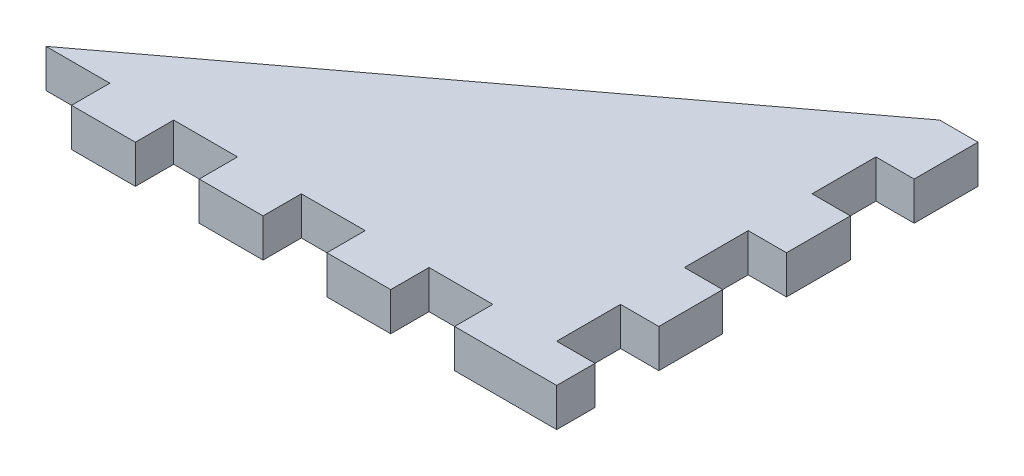
ISO-10303-21;
HEADER;
FILE_DESCRIPTION(('STEP AP214'),'2;1');
FILE_NAME('part.step','',(''),(''),'','','');
FILE_SCHEMA(('AUTOMOTIVE_DESIGN { 1 0 10303 214 1 1 1 1 }'));
ENDSEC;
DATA;
#1=APPLICATION_CONTEXT('core data for automotive mechanical design processes');
#2=APPLICATION_PROTOCOL_DEFINITION('international standard','automotive_design',2000,#1);
#3=PRODUCT_CONTEXT('',#1,'mechanical');
#4=PRODUCT('Part','Part','',(#3));
#5=PRODUCT_RELATED_PRODUCT_CATEGORY('part','',(#4));
#6=PRODUCT_DEFINITION_FORMATION('','',#4);
#7=PRODUCT_DEFINITION_CONTEXT('part definition',#1,'design');
#8=PRODUCT_DEFINITION('design','',#6,#7);
#9=PRODUCT_DEFINITION_SHAPE('','',#8);
#10=(LENGTH_UNIT() NAMED_UNIT(*) SI_UNIT(.MILLI.,.METRE.));
#11=(NAMED_UNIT(*) PLANE_ANGLE_UNIT() SI_UNIT($,.RADIAN.));
#12=(NAMED_UNIT(*) SI_UNIT($,.STERADIAN.) SOLID_ANGLE_UNIT());
#13=UNCERTAINTY_MEASURE_WITH_UNIT(LENGTH_MEASURE(1.E-05),#10,'distance_accuracy_value','');
#14=(GEOMETRIC_REPRESENTATION_CONTEXT(3) GLOBAL_UNCERTAINTY_ASSIGNED_CONTEXT((#13)) GLOBAL_UNIT_ASSIGNED_CONTEXT((#10,
#11,#12)) REPRESENTATION_CONTEXT('',''));
#15=CARTESIAN_POINT('',(0.,0.,0.));
#16=DIRECTION('',(0.,0.,1.));
#17=DIRECTION('',(1.,0.,0.));
#18=AXIS2_PLACEMENT_3D('',#15,#16,#17);
#19=CARTESIAN_POINT('',(20.,1.5,0.));
#20=DIRECTION('',(1.,0.,0.));
#21=DIRECTION('',(0.,0.,-1.));
#22=AXIS2_PLACEMENT_3D('',#19,#20,#21);
#23=PLANE('',#22);
#24=DIRECTION('',(0.,0.,1.));
#25=VECTOR('',#24,1.);
#26=CARTESIAN_POINT('',(20.,1.5,0.));
#27=LINE('',#26,#25);
#28=CARTESIAN_POINT('',(20.,1.5,9.99999999999999));
#29=VERTEX_POINT('',#28);
#30=CARTESIAN_POINT('',(20.,1.5,15.));
#31=VERTEX_POINT('',#30);
#32=EDGE_CURVE('E517',#29,#31,#27,.T.);
#33=ORIENTED_EDGE('',*,*,#32,.T.);
#34=DIRECTION('',(0.,1.,0.));
#35=VECTOR('',#34,1.);
#36=CARTESIAN_POINT('',(20.,-1.5,15.));
#37=LINE('',#36,#35);
#38=CARTESIAN_POINT('',(20.,-1.5,15.));
#39=VERTEX_POINT('',#38);
#40=EDGE_CURVE('E269',#39,#31,#37,.T.);
#41=ORIENTED_EDGE('',*,*,#40,.F.);
#42=DIRECTION('',(0.,0.,1.));
#43=VECTOR('',#42,1.);
#44=CARTESIAN_POINT('',(20.,-1.5,0.));
#45=LINE('',#44,#43);
#46=CARTESIAN_POINT('',(20.,-1.5,9.99999999999999));
#47=VERTEX_POINT('',#46);
#48=EDGE_CURVE('E510',#47,#39,#45,.T.);
#49=ORIENTED_EDGE('',*,*,#48,.F.);
#50=DIRECTION('',(0.,-1.,0.));
#51=VECTOR('',#50,1.);
#52=CARTESIAN_POINT('',(20.,0.,9.99999999999999));
#53=LINE('',#52,#51);
#54=EDGE_CURVE('E409',#29,#47,#53,.T.);
#55=ORIENTED_EDGE('',*,*,#54,.F.);
#56=EDGE_LOOP('',(#33,#41,#49,#55));
#57=FACE_BOUND('',#56,.T.);
#58=ADVANCED_FACE('F41',(#57),#23,.T.);
#59=CARTESIAN_POINT('',(0.,1.5,15.));
#60=DIRECTION('',(0.,0.,-1.));
#61=DIRECTION('',(-1.,0.,0.));
#62=AXIS2_PLACEMENT_3D('',#59,#60,#61);
#63=PLANE('',#62);
#64=DIRECTION('',(0.,-1.,0.));
#65=VECTOR('',#64,1.);
#66=CARTESIAN_POINT('',(-15.,0.,15.));
#67=LINE('',#66,#65);
#68=CARTESIAN_POINT('',(-15.,1.5,15.));
#69=VERTEX_POINT('',#68);
#70=CARTESIAN_POINT('',(-15.,-1.5,15.));
#71=VERTEX_POINT('',#70);
#72=EDGE_CURVE('E65',#69,#71,#67,.T.);
#73=ORIENTED_EDGE('',*,*,#72,.F.);
#74=DIRECTION('',(1.,0.,0.));
#75=VECTOR('',#74,1.);
#76=CARTESIAN_POINT('',(0.,1.5,15.));
#77=LINE('',#76,#75);
#78=CARTESIAN_POINT('',(-20.,1.5,15.));
#79=VERTEX_POINT('',#78);
#80=EDGE_CURVE('E521',#79,#69,#77,.T.);
#81=ORIENTED_EDGE('',*,*,#80,.F.);
#82=DIRECTION('',(0.,-1.,0.));
#83=VECTOR('',#82,1.);
#84=CARTESIAN_POINT('',(-20.,1.5,15.));
#85=LINE('',#84,#83);
#86=CARTESIAN_POINT('',(-20.,-1.5,15.));
#87=VERTEX_POINT('',#86);
#88=EDGE_CURVE('E50',#79,#87,#85,.T.);
#89=ORIENTED_EDGE('',*,*,#88,.T.);
#90=DIRECTION('',(1.,0.,0.));
#91=VECTOR('',#90,1.);
#92=CARTESIAN_POINT('',(0.,-1.5,15.));
#93=LINE('',#92,#91);
#94=EDGE_CURVE('E533',#87,#71,#93,.T.);
#95=ORIENTED_EDGE('',*,*,#94,.T.);
#96=EDGE_LOOP('',(#73,#81,#89,#95));
#97=FACE_BOUND('',#96,.T.);
#98=ADVANCED_FACE('F540',(#97),#63,.F.);
#99=CARTESIAN_POINT('',(-10.,1.5,15.));
#100=VERTEX_POINT('',#99);
#101=CARTESIAN_POINT('',(-5.,1.5,15.));
#102=VERTEX_POINT('',#101);
#103=EDGE_CURVE('E57',#100,#102,#77,.T.);
#104=ORIENTED_EDGE('',*,*,#103,.F.);
#105=DIRECTION('',(0.,-1.,0.));
#106=VECTOR('',#105,1.);
#107=CARTESIAN_POINT('',(-10.,0.,15.));
#108=LINE('',#107,#106);
#109=CARTESIAN_POINT('',(-10.,-1.5,15.));
#110=VERTEX_POINT('',#109);
#111=EDGE_CURVE('E289',#100,#110,#108,.T.);
#112=ORIENTED_EDGE('',*,*,#111,.T.);
#113=CARTESIAN_POINT('',(-5.,-1.5,15.));
#114=VERTEX_POINT('',#113);
#115=EDGE_CURVE('E535',#110,#114,#93,.T.);
#116=ORIENTED_EDGE('',*,*,#115,.T.);
#117=DIRECTION('',(0.,-1.,0.));
#118=VECTOR('',#117,1.);
#119=CARTESIAN_POINT('',(-5.,0.,15.));
#120=LINE('',#119,#118);
#121=EDGE_CURVE('E318',#102,#114,#120,.T.);
#122=ORIENTED_EDGE('',*,*,#121,.F.);
#123=EDGE_LOOP('',(#104,#112,#116,#122));
#124=FACE_BOUND('',#123,.T.);
#125=ADVANCED_FACE('F630',(#124),#63,.F.);
#126=CARTESIAN_POINT('',(0.,1.5,15.));
#127=VERTEX_POINT('',#126);
#128=CARTESIAN_POINT('',(5.,1.5,15.));
#129=VERTEX_POINT('',#128);
#130=EDGE_CURVE('E626',#127,#129,#77,.T.);
#131=ORIENTED_EDGE('',*,*,#130,.F.);
#132=DIRECTION('',(0.,-1.,0.));
#133=VECTOR('',#132,1.);
#134=CARTESIAN_POINT('',(0.,0.,15.));
#135=LINE('',#134,#133);
#136=CARTESIAN_POINT('',(0.,-1.5,15.));
#137=VERTEX_POINT('',#136);
#138=EDGE_CURVE('E324',#127,#137,#135,.T.);
#139=ORIENTED_EDGE('',*,*,#138,.T.);
#140=CARTESIAN_POINT('',(5.,-1.5,15.));
#141=VERTEX_POINT('',#140);
#142=EDGE_CURVE('E609',#137,#141,#93,.T.);
#143=ORIENTED_EDGE('',*,*,#142,.T.);
#144=DIRECTION('',(0.,-1.,0.));
#145=VECTOR('',#144,1.);
#146=CARTESIAN_POINT('',(5.,0.,15.));
#147=LINE('',#146,#145);
#148=EDGE_CURVE('E356',#129,#141,#147,.T.);
#149=ORIENTED_EDGE('',*,*,#148,.F.);
#150=EDGE_LOOP('',(#131,#139,#143,#149));
#151=FACE_BOUND('',#150,.T.);
#152=ADVANCED_FACE('F625',(#151),#63,.F.);
#153=DIRECTION('',(0.,-1.,0.));
#154=VECTOR('',#153,1.);
#155=CARTESIAN_POINT('',(20.,0.,4.99999999999999));
#156=LINE('',#155,#154);
#157=CARTESIAN_POINT('',(20.,1.5,4.99999999999999));
#158=VERTEX_POINT('',#157);
#159=CARTESIAN_POINT('',(20.,-1.5,4.99999999999999));
#160=VERTEX_POINT('',#159);
#161=EDGE_CURVE('E415',#158,#160,#156,.T.);
#162=ORIENTED_EDGE('',*,*,#161,.T.);
#163=CARTESIAN_POINT('',(20.,-1.5,0.));
#164=VERTEX_POINT('',#163);
#165=EDGE_CURVE('E529',#164,#160,#45,.T.);
#166=ORIENTED_EDGE('',*,*,#165,.F.);
#167=DIRECTION('',(0.,-1.,0.));
#168=VECTOR('',#167,1.);
#169=CARTESIAN_POINT('',(20.,0.,0.));
#170=LINE('',#169,#168);
#171=CARTESIAN_POINT('',(20.,1.5,0.));
#172=VERTEX_POINT('',#171);
#173=EDGE_CURVE('E443',#172,#164,#170,.T.);
#174=ORIENTED_EDGE('',*,*,#173,.F.);
#175=EDGE_CURVE('E516',#172,#158,#27,.T.);
#176=ORIENTED_EDGE('',*,*,#175,.T.);
#177=EDGE_LOOP('',(#162,#166,#174,#176));
#178=FACE_BOUND('',#177,.T.);
#179=ADVANCED_FACE('F648',(#178),#23,.T.);
#180=DIRECTION('',(0.,-1.,0.));
#181=VECTOR('',#180,1.);
#182=CARTESIAN_POINT('',(20.,0.,-5.00000000000001));
#183=LINE('',#182,#181);
#184=CARTESIAN_POINT('',(20.,1.5,-5.00000000000001));
#185=VERTEX_POINT('',#184);
#186=CARTESIAN_POINT('',(20.,-1.5,-5.00000000000001));
#187=VERTEX_POINT('',#186);
#188=EDGE_CURVE('E449',#185,#187,#183,.T.);
#189=ORIENTED_EDGE('',*,*,#188,.T.);
#190=CARTESIAN_POINT('',(20.,-1.5,-10.));
#191=VERTEX_POINT('',#190);
#192=EDGE_CURVE('E524',#191,#187,#45,.T.);
#193=ORIENTED_EDGE('',*,*,#192,.F.);
#194=DIRECTION('',(0.,-1.,0.));
#195=VECTOR('',#194,1.);
#196=CARTESIAN_POINT('',(20.,0.,-10.));
#197=LINE('',#196,#195);
#198=CARTESIAN_POINT('',(20.,1.5,-10.));
#199=VERTEX_POINT('',#198);
#200=EDGE_CURVE('E477',#199,#191,#197,.T.);
#201=ORIENTED_EDGE('',*,*,#200,.F.);
#202=EDGE_CURVE('E511',#199,#185,#27,.T.);
#203=ORIENTED_EDGE('',*,*,#202,.T.);
#204=EDGE_LOOP('',(#189,#193,#201,#203));
#205=FACE_BOUND('',#204,.T.);
#206=ADVANCED_FACE('F43',(#205),#23,.T.);
#207=CARTESIAN_POINT('',(0.,1.5,0.));
#208=DIRECTION('',(0.6,0.,0.8));
#209=DIRECTION('',(0.8,0.,-0.6));
#210=AXIS2_PLACEMENT_3D('',#207,#208,#209);
#211=PLANE('',#210);
#212=DIRECTION('',(-0.8,0.,0.6));
#213=VECTOR('',#212,1.);
#214=CARTESIAN_POINT('',(0.,-1.5,0.));
#215=LINE('',#214,#213);
#216=CARTESIAN_POINT('',(20.,-1.5,-15.));
#217=VERTEX_POINT('',#216);
#218=EDGE_CURVE('E528',#217,#87,#215,.T.);
#219=ORIENTED_EDGE('',*,*,#218,.T.);
#220=ORIENTED_EDGE('',*,*,#88,.F.);
#221=DIRECTION('',(-0.8,0.,0.6));
#222=VECTOR('',#221,1.);
#223=CARTESIAN_POINT('',(0.,1.5,0.));
#224=LINE('',#223,#222);
#225=CARTESIAN_POINT('',(20.,1.5,-15.));
#226=VERTEX_POINT('',#225);
#227=EDGE_CURVE('E515',#226,#79,#224,.T.);
#228=ORIENTED_EDGE('',*,*,#227,.F.);
#229=DIRECTION('',(0.,-1.,0.));
#230=VECTOR('',#229,1.);
#231=CARTESIAN_POINT('',(20.,1.5,-15.));
#232=LINE('',#231,#230);
#233=EDGE_CURVE('E11',#226,#217,#232,.T.);
#234=ORIENTED_EDGE('',*,*,#233,.T.);
#235=EDGE_LOOP('',(#219,#220,#228,#234));
#236=FACE_BOUND('',#235,.T.);
#237=ADVANCED_FACE('F557',(#236),#211,.F.);
#238=CARTESIAN_POINT('',(10.,1.5,15.));
#239=VERTEX_POINT('',#238);
#240=CARTESIAN_POINT('',(15.,1.5,15.));
#241=VERTEX_POINT('',#240);
#242=EDGE_CURVE('E520',#239,#241,#77,.T.);
#243=ORIENTED_EDGE('',*,*,#242,.F.);
#244=DIRECTION('',(0.,-1.,0.));
#245=VECTOR('',#244,1.);
#246=CARTESIAN_POINT('',(10.,0.,15.));
#247=LINE('',#246,#245);
#248=CARTESIAN_POINT('',(10.,-1.5,15.));
#249=VERTEX_POINT('',#248);
#250=EDGE_CURVE('E362',#239,#249,#247,.T.);
#251=ORIENTED_EDGE('',*,*,#250,.T.);
#252=CARTESIAN_POINT('',(15.,-1.5,15.));
#253=VERTEX_POINT('',#252);
#254=EDGE_CURVE('E532',#249,#253,#93,.T.);
#255=ORIENTED_EDGE('',*,*,#254,.T.);
#256=DIRECTION('',(0.,1.,0.));
#257=VECTOR('',#256,1.);
#258=CARTESIAN_POINT('',(15.,0.,15.));
#259=LINE('',#258,#257);
#260=EDGE_CURVE('E394',#253,#241,#259,.T.);
#261=ORIENTED_EDGE('',*,*,#260,.T.);
#262=EDGE_LOOP('',(#243,#251,#255,#261));
#263=FACE_BOUND('',#262,.T.);
#264=ADVANCED_FACE('F611',(#263),#63,.F.);
#265=CARTESIAN_POINT('',(0.,1.5,0.));
#266=DIRECTION('',(0.,1.,0.));
#267=DIRECTION('',(0.,0.,1.));
#268=AXIS2_PLACEMENT_3D('',#265,#266,#267);
#269=PLANE('',#268);
#270=ORIENTED_EDGE('',*,*,#202,.F.);
#271=DIRECTION('',(-1.,0.,0.));
#272=VECTOR('',#271,1.);
#273=CARTESIAN_POINT('',(23.,1.5,-10.));
#274=LINE('',#273,#272);
#275=CARTESIAN_POINT('',(23.,1.5,-10.));
#276=VERTEX_POINT('',#275);
#277=EDGE_CURVE('E506',#276,#199,#274,.T.);
#278=ORIENTED_EDGE('',*,*,#277,.F.);
#279=DIRECTION('',(0.,0.,1.));
#280=VECTOR('',#279,1.);
#281=CARTESIAN_POINT('',(23.,1.5,0.));
#282=LINE('',#281,#280);
#283=CARTESIAN_POINT('',(23.,1.5,-15.));
#284=VERTEX_POINT('',#283);
#285=EDGE_CURVE('E478',#284,#276,#282,.T.);
#286=ORIENTED_EDGE('',*,*,#285,.F.);
#287=DIRECTION('',(-1.,0.,0.));
#288=VECTOR('',#287,1.);
#289=CARTESIAN_POINT('',(23.,1.5,-15.));
#290=LINE('',#289,#288);
#291=EDGE_CURVE('E491',#284,#226,#290,.T.);
#292=ORIENTED_EDGE('',*,*,#291,.T.);
#293=ORIENTED_EDGE('',*,*,#227,.T.);
#294=ORIENTED_EDGE('',*,*,#80,.T.);
#295=DIRECTION('',(0.,0.,-1.));
#296=VECTOR('',#295,1.);
#297=CARTESIAN_POINT('',(-15.,1.5,18.));
#298=LINE('',#297,#296);
#299=CARTESIAN_POINT('',(-15.,1.5,18.));
#300=VERTEX_POINT('',#299);
#301=EDGE_CURVE('E314',#300,#69,#298,.T.);
#302=ORIENTED_EDGE('',*,*,#301,.F.);
#303=DIRECTION('',(-1.,0.,0.));
#304=VECTOR('',#303,1.);
#305=CARTESIAN_POINT('',(0.,1.5,18.));
#306=LINE('',#305,#304);
#307=CARTESIAN_POINT('',(-10.,1.5,18.));
#308=VERTEX_POINT('',#307);
#309=EDGE_CURVE('E284',#308,#300,#306,.T.);
#310=ORIENTED_EDGE('',*,*,#309,.F.);
#311=DIRECTION('',(0.,0.,-1.));
#312=VECTOR('',#311,1.);
#313=CARTESIAN_POINT('',(-10.,1.5,18.));
#314=LINE('',#313,#312);
#315=EDGE_CURVE('E299',#308,#100,#314,.T.);
#316=ORIENTED_EDGE('',*,*,#315,.T.);
#317=ORIENTED_EDGE('',*,*,#103,.T.);
#318=DIRECTION('',(0.,0.,-1.));
#319=VECTOR('',#318,1.);
#320=CARTESIAN_POINT('',(-5.,1.5,18.));
#321=LINE('',#320,#319);
#322=CARTESIAN_POINT('',(-5.,1.5,18.));
#323=VERTEX_POINT('',#322);
#324=EDGE_CURVE('E352',#323,#102,#321,.T.);
#325=ORIENTED_EDGE('',*,*,#324,.F.);
#326=DIRECTION('',(-1.,0.,0.));
#327=VECTOR('',#326,1.);
#328=CARTESIAN_POINT('',(0.,1.5,18.));
#329=LINE('',#328,#327);
#330=CARTESIAN_POINT('',(0.,1.5,18.));
#331=VERTEX_POINT('',#330);
#332=EDGE_CURVE('E319',#331,#323,#329,.T.);
#333=ORIENTED_EDGE('',*,*,#332,.F.);
#334=DIRECTION('',(0.,0.,-1.));
#335=VECTOR('',#334,1.);
#336=CARTESIAN_POINT('',(0.,1.5,18.));
#337=LINE('',#336,#335);
#338=EDGE_CURVE('E334',#331,#127,#337,.T.);
#339=ORIENTED_EDGE('',*,*,#338,.T.);
#340=ORIENTED_EDGE('',*,*,#130,.T.);
#341=DIRECTION('',(0.,0.,-1.));
#342=VECTOR('',#341,1.);
#343=CARTESIAN_POINT('',(5.,1.5,18.));
#344=LINE('',#343,#342);
#345=CARTESIAN_POINT('',(5.,1.5,18.));
#346=VERTEX_POINT('',#345);
#347=EDGE_CURVE('E390',#346,#129,#344,.T.);
#348=ORIENTED_EDGE('',*,*,#347,.F.);
#349=DIRECTION('',(-1.,0.,0.));
#350=VECTOR('',#349,1.);
#351=CARTESIAN_POINT('',(0.,1.5,18.));
#352=LINE('',#351,#350);
#353=CARTESIAN_POINT('',(10.,1.5,18.));
#354=VERTEX_POINT('',#353);
#355=EDGE_CURVE('E357',#354,#346,#352,.T.);
#356=ORIENTED_EDGE('',*,*,#355,.F.);
#357=DIRECTION('',(0.,0.,-1.));
#358=VECTOR('',#357,1.);
#359=CARTESIAN_POINT('',(10.,1.5,18.));
#360=LINE('',#359,#358);
#361=EDGE_CURVE('E372',#354,#239,#360,.T.);
#362=ORIENTED_EDGE('',*,*,#361,.T.);
#363=ORIENTED_EDGE('',*,*,#242,.T.);
#364=DIRECTION('',(0.,0.,-1.));
#365=VECTOR('',#364,1.);
#366=CARTESIAN_POINT('',(15.,1.5,18.));
#367=LINE('',#366,#365);
#368=CARTESIAN_POINT('',(15.,1.5,18.));
#369=VERTEX_POINT('',#368);
#370=EDGE_CURVE('E399',#369,#241,#367,.T.);
#371=ORIENTED_EDGE('',*,*,#370,.F.);
#372=DIRECTION('',(-1.,0.,0.));
#373=VECTOR('',#372,1.);
#374=CARTESIAN_POINT('',(0.,1.5,18.));
#375=LINE('',#374,#373);
#376=CARTESIAN_POINT('',(23.,1.5,18.));
#377=VERTEX_POINT('',#376);
#378=EDGE_CURVE('E251',#377,#369,#375,.T.);
#379=ORIENTED_EDGE('',*,*,#378,.F.);
#380=DIRECTION('',(0.,0.,1.));
#381=VECTOR('',#380,1.);
#382=CARTESIAN_POINT('',(23.,1.5,18.));
#383=LINE('',#382,#381);
#384=CARTESIAN_POINT('',(23.,1.5,15.));
#385=VERTEX_POINT('',#384);
#386=EDGE_CURVE('E267',#385,#377,#383,.T.);
#387=ORIENTED_EDGE('',*,*,#386,.F.);
#388=DIRECTION('',(-1.,0.,0.));
#389=VECTOR('',#388,1.);
#390=CARTESIAN_POINT('',(23.,1.5,15.));
#391=LINE('',#390,#389);
#392=EDGE_CURVE('E277',#385,#31,#391,.T.);
#393=ORIENTED_EDGE('',*,*,#392,.T.);
#394=ORIENTED_EDGE('',*,*,#32,.F.);
#395=DIRECTION('',(-1.,0.,0.));
#396=VECTOR('',#395,1.);
#397=CARTESIAN_POINT('',(23.,1.5,9.99999999999999));
#398=LINE('',#397,#396);
#399=CARTESIAN_POINT('',(23.,1.5,9.99999999999999));
#400=VERTEX_POINT('',#399);
#401=EDGE_CURVE('E440',#400,#29,#398,.T.);
#402=ORIENTED_EDGE('',*,*,#401,.F.);
#403=DIRECTION('',(0.,0.,1.));
#404=VECTOR('',#403,1.);
#405=CARTESIAN_POINT('',(23.,1.5,0.));
#406=LINE('',#405,#404);
#407=CARTESIAN_POINT('',(23.,1.5,4.99999999999999));
#408=VERTEX_POINT('',#407);
#409=EDGE_CURVE('E410',#408,#400,#406,.T.);
#410=ORIENTED_EDGE('',*,*,#409,.F.);
#411=DIRECTION('',(-1.,0.,0.));
#412=VECTOR('',#411,1.);
#413=CARTESIAN_POINT('',(23.,1.5,4.99999999999999));
#414=LINE('',#413,#412);
#415=EDGE_CURVE('E425',#408,#158,#414,.T.);
#416=ORIENTED_EDGE('',*,*,#415,.T.);
#417=ORIENTED_EDGE('',*,*,#175,.F.);
#418=DIRECTION('',(-1.,0.,0.));
#419=VECTOR('',#418,1.);
#420=CARTESIAN_POINT('',(23.,1.5,0.));
#421=LINE('',#420,#419);
#422=CARTESIAN_POINT('',(23.,1.5,0.));
#423=VERTEX_POINT('',#422);
#424=EDGE_CURVE('E474',#423,#172,#421,.T.);
#425=ORIENTED_EDGE('',*,*,#424,.F.);
#426=DIRECTION('',(0.,0.,1.));
#427=VECTOR('',#426,1.);
#428=CARTESIAN_POINT('',(23.,1.5,0.));
#429=LINE('',#428,#427);
#430=CARTESIAN_POINT('',(23.,1.5,-5.00000000000001));
#431=VERTEX_POINT('',#430);
#432=EDGE_CURVE('E444',#431,#423,#429,.T.);
#433=ORIENTED_EDGE('',*,*,#432,.F.);
#434=DIRECTION('',(-1.,0.,0.));
#435=VECTOR('',#434,1.);
#436=CARTESIAN_POINT('',(23.,1.5,-5.00000000000001));
#437=LINE('',#436,#435);
#438=EDGE_CURVE('E459',#431,#185,#437,.T.);
#439=ORIENTED_EDGE('',*,*,#438,.T.);
#440=EDGE_LOOP('',(#270,#278,#286,#292,#293,#294,#302,#310,#316,#317,#325,#333,#339,#340,#348,
#356,#362,#363,#371,#379,#387,#393,#394,#402,#410,#416,#417,#425,#433,#439));
#441=FACE_BOUND('',#440,.T.);
#442=ADVANCED_FACE('F552',(#441),#269,.T.);
#443=CARTESIAN_POINT('',(0.,-1.5,0.));
#444=DIRECTION('',(0.,1.,0.));
#445=DIRECTION('',(0.,0.,1.));
#446=AXIS2_PLACEMENT_3D('',#443,#444,#445);
#447=PLANE('',#446);
#448=ORIENTED_EDGE('',*,*,#218,.F.);
#449=DIRECTION('',(-1.,0.,0.));
#450=VECTOR('',#449,1.);
#451=CARTESIAN_POINT('',(23.,-1.5,-15.));
#452=LINE('',#451,#450);
#453=CARTESIAN_POINT('',(23.,-1.5,-15.));
#454=VERTEX_POINT('',#453);
#455=EDGE_CURVE('E498',#454,#217,#452,.T.);
#456=ORIENTED_EDGE('',*,*,#455,.F.);
#457=DIRECTION('',(0.,0.,-1.));
#458=VECTOR('',#457,1.);
#459=CARTESIAN_POINT('',(23.,-1.5,0.));
#460=LINE('',#459,#458);
#461=CARTESIAN_POINT('',(23.,-1.5,-10.));
#462=VERTEX_POINT('',#461);
#463=EDGE_CURVE('E485',#462,#454,#460,.T.);
#464=ORIENTED_EDGE('',*,*,#463,.F.);
#465=DIRECTION('',(-1.,0.,0.));
#466=VECTOR('',#465,1.);
#467=CARTESIAN_POINT('',(23.,-1.5,-10.));
#468=LINE('',#467,#466);
#469=EDGE_CURVE('E502',#462,#191,#468,.T.);
#470=ORIENTED_EDGE('',*,*,#469,.T.);
#471=ORIENTED_EDGE('',*,*,#192,.T.);
#472=DIRECTION('',(-1.,0.,0.));
#473=VECTOR('',#472,1.);
#474=CARTESIAN_POINT('',(23.,-1.5,-5.00000000000001));
#475=LINE('',#474,#473);
#476=CARTESIAN_POINT('',(23.,-1.5,-5.00000000000001));
#477=VERTEX_POINT('',#476);
#478=EDGE_CURVE('E468',#477,#187,#475,.T.);
#479=ORIENTED_EDGE('',*,*,#478,.F.);
#480=DIRECTION('',(0.,0.,-1.));
#481=VECTOR('',#480,1.);
#482=CARTESIAN_POINT('',(23.,-1.5,0.));
#483=LINE('',#482,#481);
#484=CARTESIAN_POINT('',(23.,-1.5,0.));
#485=VERTEX_POINT('',#484);
#486=EDGE_CURVE('E452',#485,#477,#483,.T.);
#487=ORIENTED_EDGE('',*,*,#486,.F.);
#488=DIRECTION('',(-1.,0.,0.));
#489=VECTOR('',#488,1.);
#490=CARTESIAN_POINT('',(23.,-1.5,0.));
#491=LINE('',#490,#489);
#492=EDGE_CURVE('E471',#485,#164,#491,.T.);
#493=ORIENTED_EDGE('',*,*,#492,.T.);
#494=ORIENTED_EDGE('',*,*,#165,.T.);
#495=DIRECTION('',(-1.,0.,0.));
#496=VECTOR('',#495,1.);
#497=CARTESIAN_POINT('',(23.,-1.5,4.99999999999999));
#498=LINE('',#497,#496);
#499=CARTESIAN_POINT('',(23.,-1.5,4.99999999999999));
#500=VERTEX_POINT('',#499);
#501=EDGE_CURVE('E434',#500,#160,#498,.T.);
#502=ORIENTED_EDGE('',*,*,#501,.F.);
#503=DIRECTION('',(0.,0.,-1.));
#504=VECTOR('',#503,1.);
#505=CARTESIAN_POINT('',(23.,-1.5,0.));
#506=LINE('',#505,#504);
#507=CARTESIAN_POINT('',(23.,-1.5,9.99999999999999));
#508=VERTEX_POINT('',#507);
#509=EDGE_CURVE('E418',#508,#500,#506,.T.);
#510=ORIENTED_EDGE('',*,*,#509,.F.);
#511=DIRECTION('',(-1.,0.,0.));
#512=VECTOR('',#511,1.);
#513=CARTESIAN_POINT('',(23.,-1.5,9.99999999999999));
#514=LINE('',#513,#512);
#515=EDGE_CURVE('E437',#508,#47,#514,.T.);
#516=ORIENTED_EDGE('',*,*,#515,.T.);
#517=ORIENTED_EDGE('',*,*,#48,.T.);
#518=DIRECTION('',(-1.,0.,0.));
#519=VECTOR('',#518,1.);
#520=CARTESIAN_POINT('',(23.,-1.5,15.));
#521=LINE('',#520,#519);
#522=CARTESIAN_POINT('',(23.,-1.5,15.));
#523=VERTEX_POINT('',#522);
#524=EDGE_CURVE('E258',#523,#39,#521,.T.);
#525=ORIENTED_EDGE('',*,*,#524,.F.);
#526=DIRECTION('',(0.,0.,-1.));
#527=VECTOR('',#526,1.);
#528=CARTESIAN_POINT('',(23.,-1.5,18.));
#529=LINE('',#528,#527);
#530=CARTESIAN_POINT('',(23.,-1.5,18.));
#531=VERTEX_POINT('',#530);
#532=EDGE_CURVE('E254',#531,#523,#529,.T.);
#533=ORIENTED_EDGE('',*,*,#532,.F.);
#534=DIRECTION('',(1.,0.,0.));
#535=VECTOR('',#534,1.);
#536=CARTESIAN_POINT('',(0.,-1.5,18.));
#537=LINE('',#536,#535);
#538=CARTESIAN_POINT('',(15.,-1.5,18.));
#539=VERTEX_POINT('',#538);
#540=EDGE_CURVE('E241',#539,#531,#537,.T.);
#541=ORIENTED_EDGE('',*,*,#540,.F.);
#542=DIRECTION('',(0.,0.,-1.));
#543=VECTOR('',#542,1.);
#544=CARTESIAN_POINT('',(15.,-1.5,18.));
#545=LINE('',#544,#543);
#546=EDGE_CURVE('E406',#539,#253,#545,.T.);
#547=ORIENTED_EDGE('',*,*,#546,.T.);
#548=ORIENTED_EDGE('',*,*,#254,.F.);
#549=DIRECTION('',(0.,0.,-1.));
#550=VECTOR('',#549,1.);
#551=CARTESIAN_POINT('',(10.,-1.5,18.));
#552=LINE('',#551,#550);
#553=CARTESIAN_POINT('',(10.,-1.5,18.));
#554=VERTEX_POINT('',#553);
#555=EDGE_CURVE('E382',#554,#249,#552,.T.);
#556=ORIENTED_EDGE('',*,*,#555,.F.);
#557=DIRECTION('',(1.,0.,0.));
#558=VECTOR('',#557,1.);
#559=CARTESIAN_POINT('',(0.,-1.5,18.));
#560=LINE('',#559,#558);
#561=CARTESIAN_POINT('',(5.,-1.5,18.));
#562=VERTEX_POINT('',#561);
#563=EDGE_CURVE('E365',#562,#554,#560,.T.);
#564=ORIENTED_EDGE('',*,*,#563,.F.);
#565=DIRECTION('',(0.,0.,-1.));
#566=VECTOR('',#565,1.);
#567=CARTESIAN_POINT('',(5.,-1.5,18.));
#568=LINE('',#567,#566);
#569=EDGE_CURVE('E386',#562,#141,#568,.T.);
#570=ORIENTED_EDGE('',*,*,#569,.T.);
#571=ORIENTED_EDGE('',*,*,#142,.F.);
#572=DIRECTION('',(0.,0.,-1.));
#573=VECTOR('',#572,1.);
#574=CARTESIAN_POINT('',(0.,-1.5,18.));
#575=LINE('',#574,#573);
#576=CARTESIAN_POINT('',(0.,-1.5,18.));
#577=VERTEX_POINT('',#576);
#578=EDGE_CURVE('E344',#577,#137,#575,.T.);
#579=ORIENTED_EDGE('',*,*,#578,.F.);
#580=DIRECTION('',(1.,0.,0.));
#581=VECTOR('',#580,1.);
#582=CARTESIAN_POINT('',(0.,-1.5,18.));
#583=LINE('',#582,#581);
#584=CARTESIAN_POINT('',(-5.,-1.5,18.));
#585=VERTEX_POINT('',#584);
#586=EDGE_CURVE('E327',#585,#577,#583,.T.);
#587=ORIENTED_EDGE('',*,*,#586,.F.);
#588=DIRECTION('',(0.,0.,-1.));
#589=VECTOR('',#588,1.);
#590=CARTESIAN_POINT('',(-5.,-1.5,18.));
#591=LINE('',#590,#589);
#592=EDGE_CURVE('E348',#585,#114,#591,.T.);
#593=ORIENTED_EDGE('',*,*,#592,.T.);
#594=ORIENTED_EDGE('',*,*,#115,.F.);
#595=DIRECTION('',(0.,0.,-1.));
#596=VECTOR('',#595,1.);
#597=CARTESIAN_POINT('',(-10.,-1.5,18.));
#598=LINE('',#597,#596);
#599=CARTESIAN_POINT('',(-10.,-1.5,18.));
#600=VERTEX_POINT('',#599);
#601=EDGE_CURVE('E306',#600,#110,#598,.T.);
#602=ORIENTED_EDGE('',*,*,#601,.F.);
#603=DIRECTION('',(1.,0.,0.));
#604=VECTOR('',#603,1.);
#605=CARTESIAN_POINT('',(0.,-1.5,18.));
#606=LINE('',#605,#604);
#607=CARTESIAN_POINT('',(-15.,-1.5,18.));
#608=VERTEX_POINT('',#607);
#609=EDGE_CURVE('E292',#608,#600,#606,.T.);
#610=ORIENTED_EDGE('',*,*,#609,.F.);
#611=DIRECTION('',(0.,0.,-1.));
#612=VECTOR('',#611,1.);
#613=CARTESIAN_POINT('',(-15.,-1.5,18.));
#614=LINE('',#613,#612);
#615=EDGE_CURVE('E310',#608,#71,#614,.T.);
#616=ORIENTED_EDGE('',*,*,#615,.T.);
#617=ORIENTED_EDGE('',*,*,#94,.F.);
#618=EDGE_LOOP('',(#448,#456,#464,#470,#471,#479,#487,#493,#494,#502,#510,#516,#517,#525,#533,
#541,#547,#548,#556,#564,#570,#571,#579,#587,#593,#594,#602,#610,#616,#617));
#619=FACE_BOUND('',#618,.T.);
#620=ADVANCED_FACE('F256',(#619),#447,.F.);
#621=CARTESIAN_POINT('',(23.,0.,-10.));
#622=DIRECTION('',(0.,0.,-1.));
#623=DIRECTION('',(-1.,0.,0.));
#624=AXIS2_PLACEMENT_3D('',#621,#622,#623);
#625=PLANE('',#624);
#626=ORIENTED_EDGE('',*,*,#200,.T.);
#627=ORIENTED_EDGE('',*,*,#469,.F.);
#628=DIRECTION('',(0.,-1.,0.));
#629=VECTOR('',#628,1.);
#630=CARTESIAN_POINT('',(23.,0.,-10.));
#631=LINE('',#630,#629);
#632=EDGE_CURVE('E482',#276,#462,#631,.T.);
#633=ORIENTED_EDGE('',*,*,#632,.F.);
#634=ORIENTED_EDGE('',*,*,#277,.T.);
#635=EDGE_LOOP('',(#626,#627,#633,#634));
#636=FACE_BOUND('',#635,.T.);
#637=ADVANCED_FACE('F567',(#636),#625,.F.);
#638=CARTESIAN_POINT('',(23.,0.,-15.));
#639=DIRECTION('',(0.,0.,1.));
#640=DIRECTION('',(1.,0.,0.));
#641=AXIS2_PLACEMENT_3D('',#638,#639,#640);
#642=PLANE('',#641);
#643=ORIENTED_EDGE('',*,*,#233,.F.);
#644=ORIENTED_EDGE('',*,*,#291,.F.);
#645=DIRECTION('',(0.,1.,0.));
#646=VECTOR('',#645,1.);
#647=CARTESIAN_POINT('',(23.,0.,-15.));
#648=LINE('',#647,#646);
#649=EDGE_CURVE('E488',#454,#284,#648,.T.);
#650=ORIENTED_EDGE('',*,*,#649,.F.);
#651=ORIENTED_EDGE('',*,*,#455,.T.);
#652=EDGE_LOOP('',(#643,#644,#650,#651));
#653=FACE_BOUND('',#652,.T.);
#654=ADVANCED_FACE('F559',(#653),#642,.F.);
#655=CARTESIAN_POINT('',(23.,0.,0.));
#656=DIRECTION('',(1.,0.,0.));
#657=DIRECTION('',(0.,0.,-1.));
#658=AXIS2_PLACEMENT_3D('',#655,#656,#657);
#659=PLANE('',#658);
#660=ORIENTED_EDGE('',*,*,#285,.T.);
#661=ORIENTED_EDGE('',*,*,#632,.T.);
#662=ORIENTED_EDGE('',*,*,#463,.T.);
#663=ORIENTED_EDGE('',*,*,#649,.T.);
#664=EDGE_LOOP('',(#660,#661,#662,#663));
#665=FACE_BOUND('',#664,.T.);
#666=ADVANCED_FACE('F564',(#665),#659,.T.);
#667=CARTESIAN_POINT('',(23.,0.,0.));
#668=DIRECTION('',(0.,0.,-1.));
#669=DIRECTION('',(0.,1.,0.));
#670=AXIS2_PLACEMENT_3D('',#667,#668,#669);
#671=PLANE('',#670);
#672=ORIENTED_EDGE('',*,*,#173,.T.);
#673=ORIENTED_EDGE('',*,*,#492,.F.);
#674=DIRECTION('',(0.,-1.,0.));
#675=VECTOR('',#674,1.);
#676=CARTESIAN_POINT('',(23.,0.,0.));
#677=LINE('',#676,#675);
#678=EDGE_CURVE('E448',#423,#485,#677,.T.);
#679=ORIENTED_EDGE('',*,*,#678,.F.);
#680=ORIENTED_EDGE('',*,*,#424,.T.);
#681=EDGE_LOOP('',(#672,#673,#679,#680));
#682=FACE_BOUND('',#681,.T.);
#683=ADVANCED_FACE('F581',(#682),#671,.F.);
#684=CARTESIAN_POINT('',(23.,0.,-5.00000000000001));
#685=DIRECTION('',(0.,0.,-1.));
#686=DIRECTION('',(-1.,0.,0.));
#687=AXIS2_PLACEMENT_3D('',#684,#685,#686);
#688=PLANE('',#687);
#689=ORIENTED_EDGE('',*,*,#188,.F.);
#690=ORIENTED_EDGE('',*,*,#438,.F.);
#691=DIRECTION('',(0.,-1.,0.));
#692=VECTOR('',#691,1.);
#693=CARTESIAN_POINT('',(23.,0.,-5.00000000000001));
#694=LINE('',#693,#692);
#695=EDGE_CURVE('E455',#431,#477,#694,.T.);
#696=ORIENTED_EDGE('',*,*,#695,.T.);
#697=ORIENTED_EDGE('',*,*,#478,.T.);
#698=EDGE_LOOP('',(#689,#690,#696,#697));
#699=FACE_BOUND('',#698,.T.);
#700=ADVANCED_FACE('F574',(#699),#688,.T.);
#701=CARTESIAN_POINT('',(23.,0.,0.));
#702=DIRECTION('',(1.,0.,0.));
#703=DIRECTION('',(0.,0.,-1.));
#704=AXIS2_PLACEMENT_3D('',#701,#702,#703);
#705=PLANE('',#704);
#706=ORIENTED_EDGE('',*,*,#432,.T.);
#707=ORIENTED_EDGE('',*,*,#678,.T.);
#708=ORIENTED_EDGE('',*,*,#486,.T.);
#709=ORIENTED_EDGE('',*,*,#695,.F.);
#710=EDGE_LOOP('',(#706,#707,#708,#709));
#711=FACE_BOUND('',#710,.T.);
#712=ADVANCED_FACE('F578',(#711),#705,.T.);
#713=CARTESIAN_POINT('',(23.,0.,9.99999999999999));
#714=DIRECTION('',(0.,0.,-1.));
#715=DIRECTION('',(-1.,0.,0.));
#716=AXIS2_PLACEMENT_3D('',#713,#714,#715);
#717=PLANE('',#716);
#718=ORIENTED_EDGE('',*,*,#54,.T.);
#719=ORIENTED_EDGE('',*,*,#515,.F.);
#720=DIRECTION('',(0.,-1.,0.));
#721=VECTOR('',#720,1.);
#722=CARTESIAN_POINT('',(23.,0.,9.99999999999999));
#723=LINE('',#722,#721);
#724=EDGE_CURVE('E414',#400,#508,#723,.T.);
#725=ORIENTED_EDGE('',*,*,#724,.F.);
#726=ORIENTED_EDGE('',*,*,#401,.T.);
#727=EDGE_LOOP('',(#718,#719,#725,#726));
#728=FACE_BOUND('',#727,.T.);
#729=ADVANCED_FACE('F657',(#728),#717,.F.);
#730=CARTESIAN_POINT('',(23.,0.,4.99999999999999));
#731=DIRECTION('',(0.,0.,-1.));
#732=DIRECTION('',(-1.,0.,0.));
#733=AXIS2_PLACEMENT_3D('',#730,#731,#732);
#734=PLANE('',#733);
#735=ORIENTED_EDGE('',*,*,#161,.F.);
#736=ORIENTED_EDGE('',*,*,#415,.F.);
#737=DIRECTION('',(0.,-1.,0.));
#738=VECTOR('',#737,1.);
#739=CARTESIAN_POINT('',(23.,0.,4.99999999999999));
#740=LINE('',#739,#738);
#741=EDGE_CURVE('E421',#408,#500,#740,.T.);
#742=ORIENTED_EDGE('',*,*,#741,.T.);
#743=ORIENTED_EDGE('',*,*,#501,.T.);
#744=EDGE_LOOP('',(#735,#736,#742,#743));
#745=FACE_BOUND('',#744,.T.);
#746=ADVANCED_FACE('F653',(#745),#734,.T.);
#747=CARTESIAN_POINT('',(23.,0.,0.));
#748=DIRECTION('',(1.,0.,0.));
#749=DIRECTION('',(0.,0.,-1.));
#750=AXIS2_PLACEMENT_3D('',#747,#748,#749);
#751=PLANE('',#750);
#752=ORIENTED_EDGE('',*,*,#409,.T.);
#753=ORIENTED_EDGE('',*,*,#724,.T.);
#754=ORIENTED_EDGE('',*,*,#509,.T.);
#755=ORIENTED_EDGE('',*,*,#741,.F.);
#756=EDGE_LOOP('',(#752,#753,#754,#755));
#757=FACE_BOUND('',#756,.T.);
#758=ADVANCED_FACE('F655',(#757),#751,.T.);
#759=CARTESIAN_POINT('',(15.,0.,18.));
#760=DIRECTION('',(-1.,0.,0.));
#761=DIRECTION('',(0.,0.,1.));
#762=AXIS2_PLACEMENT_3D('',#759,#760,#761);
#763=PLANE('',#762);
#764=ORIENTED_EDGE('',*,*,#260,.F.);
#765=ORIENTED_EDGE('',*,*,#546,.F.);
#766=DIRECTION('',(0.,1.,0.));
#767=VECTOR('',#766,1.);
#768=CARTESIAN_POINT('',(15.,0.,18.));
#769=LINE('',#768,#767);
#770=EDGE_CURVE('E247',#539,#369,#769,.T.);
#771=ORIENTED_EDGE('',*,*,#770,.T.);
#772=ORIENTED_EDGE('',*,*,#370,.T.);
#773=EDGE_LOOP('',(#764,#765,#771,#772));
#774=FACE_BOUND('',#773,.T.);
#775=ADVANCED_FACE('F604',(#774),#763,.T.);
#776=CARTESIAN_POINT('',(0.,0.,18.));
#777=DIRECTION('',(0.,0.,1.));
#778=DIRECTION('',(1.,0.,0.));
#779=AXIS2_PLACEMENT_3D('',#776,#777,#778);
#780=PLANE('',#779);
#781=ORIENTED_EDGE('',*,*,#770,.F.);
#782=ORIENTED_EDGE('',*,*,#540,.T.);
#783=DIRECTION('',(0.,-1.,0.));
#784=VECTOR('',#783,1.);
#785=CARTESIAN_POINT('',(23.,-1.5,18.));
#786=LINE('',#785,#784);
#787=EDGE_CURVE('E245',#377,#531,#786,.T.);
#788=ORIENTED_EDGE('',*,*,#787,.F.);
#789=ORIENTED_EDGE('',*,*,#378,.T.);
#790=EDGE_LOOP('',(#781,#782,#788,#789));
#791=FACE_BOUND('',#790,.T.);
#792=ADVANCED_FACE('F243',(#791),#780,.T.);
#793=CARTESIAN_POINT('',(5.,0.,18.));
#794=DIRECTION('',(1.,0.,0.));
#795=DIRECTION('',(0.,0.,-1.));
#796=AXIS2_PLACEMENT_3D('',#793,#794,#795);
#797=PLANE('',#796);
#798=ORIENTED_EDGE('',*,*,#148,.T.);
#799=ORIENTED_EDGE('',*,*,#569,.F.);
#800=DIRECTION('',(0.,-1.,0.));
#801=VECTOR('',#800,1.);
#802=CARTESIAN_POINT('',(5.,0.,18.));
#803=LINE('',#802,#801);
#804=EDGE_CURVE('E361',#346,#562,#803,.T.);
#805=ORIENTED_EDGE('',*,*,#804,.F.);
#806=ORIENTED_EDGE('',*,*,#347,.T.);
#807=EDGE_LOOP('',(#798,#799,#805,#806));
#808=FACE_BOUND('',#807,.T.);
#809=ADVANCED_FACE('F622',(#808),#797,.F.);
#810=CARTESIAN_POINT('',(10.,0.,18.));
#811=DIRECTION('',(1.,0.,0.));
#812=DIRECTION('',(0.,0.,-1.));
#813=AXIS2_PLACEMENT_3D('',#810,#811,#812);
#814=PLANE('',#813);
#815=ORIENTED_EDGE('',*,*,#250,.F.);
#816=ORIENTED_EDGE('',*,*,#361,.F.);
#817=DIRECTION('',(0.,-1.,0.));
#818=VECTOR('',#817,1.);
#819=CARTESIAN_POINT('',(10.,0.,18.));
#820=LINE('',#819,#818);
#821=EDGE_CURVE('E368',#354,#554,#820,.T.);
#822=ORIENTED_EDGE('',*,*,#821,.T.);
#823=ORIENTED_EDGE('',*,*,#555,.T.);
#824=EDGE_LOOP('',(#815,#816,#822,#823));
#825=FACE_BOUND('',#824,.T.);
#826=ADVANCED_FACE('F613',(#825),#814,.T.);
#827=CARTESIAN_POINT('',(0.,0.,18.));
#828=DIRECTION('',(0.,0.,1.));
#829=DIRECTION('',(1.,0.,0.));
#830=AXIS2_PLACEMENT_3D('',#827,#828,#829);
#831=PLANE('',#830);
#832=ORIENTED_EDGE('',*,*,#355,.T.);
#833=ORIENTED_EDGE('',*,*,#804,.T.);
#834=ORIENTED_EDGE('',*,*,#563,.T.);
#835=ORIENTED_EDGE('',*,*,#821,.F.);
#836=EDGE_LOOP('',(#832,#833,#834,#835));
#837=FACE_BOUND('',#836,.T.);
#838=ADVANCED_FACE('F617',(#837),#831,.T.);
#839=CARTESIAN_POINT('',(-5.,0.,18.));
#840=DIRECTION('',(1.,0.,0.));
#841=DIRECTION('',(0.,0.,-1.));
#842=AXIS2_PLACEMENT_3D('',#839,#840,#841);
#843=PLANE('',#842);
#844=ORIENTED_EDGE('',*,*,#121,.T.);
#845=ORIENTED_EDGE('',*,*,#592,.F.);
#846=DIRECTION('',(0.,-1.,0.));
#847=VECTOR('',#846,1.);
#848=CARTESIAN_POINT('',(-5.,0.,18.));
#849=LINE('',#848,#847);
#850=EDGE_CURVE('E323',#323,#585,#849,.T.);
#851=ORIENTED_EDGE('',*,*,#850,.F.);
#852=ORIENTED_EDGE('',*,*,#324,.T.);
#853=EDGE_LOOP('',(#844,#845,#851,#852));
#854=FACE_BOUND('',#853,.T.);
#855=ADVANCED_FACE('F634',(#854),#843,.F.);
#856=CARTESIAN_POINT('',(0.,0.,18.));
#857=DIRECTION('',(1.,0.,0.));
#858=DIRECTION('',(0.,0.,-1.));
#859=AXIS2_PLACEMENT_3D('',#856,#857,#858);
#860=PLANE('',#859);
#861=ORIENTED_EDGE('',*,*,#138,.F.);
#862=ORIENTED_EDGE('',*,*,#338,.F.);
#863=DIRECTION('',(0.,-1.,0.));
#864=VECTOR('',#863,1.);
#865=CARTESIAN_POINT('',(0.,0.,18.));
#866=LINE('',#865,#864);
#867=EDGE_CURVE('E330',#331,#577,#866,.T.);
#868=ORIENTED_EDGE('',*,*,#867,.T.);
#869=ORIENTED_EDGE('',*,*,#578,.T.);
#870=EDGE_LOOP('',(#861,#862,#868,#869));
#871=FACE_BOUND('',#870,.T.);
#872=ADVANCED_FACE('F787',(#871),#860,.T.);
#873=CARTESIAN_POINT('',(0.,0.,18.));
#874=DIRECTION('',(0.,0.,1.));
#875=DIRECTION('',(1.,0.,0.));
#876=AXIS2_PLACEMENT_3D('',#873,#874,#875);
#877=PLANE('',#876);
#878=ORIENTED_EDGE('',*,*,#332,.T.);
#879=ORIENTED_EDGE('',*,*,#850,.T.);
#880=ORIENTED_EDGE('',*,*,#586,.T.);
#881=ORIENTED_EDGE('',*,*,#867,.F.);
#882=EDGE_LOOP('',(#878,#879,#880,#881));
#883=FACE_BOUND('',#882,.T.);
#884=ADVANCED_FACE('F639',(#883),#877,.T.);
#885=CARTESIAN_POINT('',(-15.,0.,18.));
#886=DIRECTION('',(1.,0.,0.));
#887=DIRECTION('',(0.,0.,-1.));
#888=AXIS2_PLACEMENT_3D('',#885,#886,#887);
#889=PLANE('',#888);
#890=ORIENTED_EDGE('',*,*,#72,.T.);
#891=ORIENTED_EDGE('',*,*,#615,.F.);
#892=DIRECTION('',(0.,-1.,0.));
#893=VECTOR('',#892,1.);
#894=CARTESIAN_POINT('',(-15.,0.,18.));
#895=LINE('',#894,#893);
#896=EDGE_CURVE('E288',#300,#608,#895,.T.);
#897=ORIENTED_EDGE('',*,*,#896,.F.);
#898=ORIENTED_EDGE('',*,*,#301,.T.);
#899=EDGE_LOOP('',(#890,#891,#897,#898));
#900=FACE_BOUND('',#899,.T.);
#901=ADVANCED_FACE('F547',(#900),#889,.F.);
#902=CARTESIAN_POINT('',(-10.,0.,18.));
#903=DIRECTION('',(1.,0.,0.));
#904=DIRECTION('',(0.,0.,-1.));
#905=AXIS2_PLACEMENT_3D('',#902,#903,#904);
#906=PLANE('',#905);
#907=ORIENTED_EDGE('',*,*,#111,.F.);
#908=ORIENTED_EDGE('',*,*,#315,.F.);
#909=DIRECTION('',(0.,-1.,0.));
#910=VECTOR('',#909,1.);
#911=CARTESIAN_POINT('',(-10.,0.,18.));
#912=LINE('',#911,#910);
#913=EDGE_CURVE('E295',#308,#600,#912,.T.);
#914=ORIENTED_EDGE('',*,*,#913,.T.);
#915=ORIENTED_EDGE('',*,*,#601,.T.);
#916=EDGE_LOOP('',(#907,#908,#914,#915));
#917=FACE_BOUND('',#916,.T.);
#918=ADVANCED_FACE('F815',(#917),#906,.T.);
#919=CARTESIAN_POINT('',(0.,0.,18.));
#920=DIRECTION('',(0.,0.,1.));
#921=DIRECTION('',(1.,0.,0.));
#922=AXIS2_PLACEMENT_3D('',#919,#920,#921);
#923=PLANE('',#922);
#924=ORIENTED_EDGE('',*,*,#309,.T.);
#925=ORIENTED_EDGE('',*,*,#896,.T.);
#926=ORIENTED_EDGE('',*,*,#609,.T.);
#927=ORIENTED_EDGE('',*,*,#913,.F.);
#928=EDGE_LOOP('',(#924,#925,#926,#927));
#929=FACE_BOUND('',#928,.T.);
#930=ADVANCED_FACE('F824',(#929),#923,.T.);
#931=CARTESIAN_POINT('',(23.,-1.5,15.));
#932=DIRECTION('',(0.,0.,1.));
#933=DIRECTION('',(1.,0.,0.));
#934=AXIS2_PLACEMENT_3D('',#931,#932,#933);
#935=PLANE('',#934);
#936=ORIENTED_EDGE('',*,*,#40,.T.);
#937=ORIENTED_EDGE('',*,*,#392,.F.);
#938=DIRECTION('',(0.,1.,0.));
#939=VECTOR('',#938,1.);
#940=CARTESIAN_POINT('',(23.,-1.5,15.));
#941=LINE('',#940,#939);
#942=EDGE_CURVE('E262',#523,#385,#941,.T.);
#943=ORIENTED_EDGE('',*,*,#942,.F.);
#944=ORIENTED_EDGE('',*,*,#524,.T.);
#945=EDGE_LOOP('',(#936,#937,#943,#944));
#946=FACE_BOUND('',#945,.T.);
#947=ADVANCED_FACE('F599',(#946),#935,.F.);
#948=CARTESIAN_POINT('',(23.,0.,0.));
#949=DIRECTION('',(-1.,0.,0.));
#950=DIRECTION('',(0.,0.,1.));
#951=AXIS2_PLACEMENT_3D('',#948,#949,#950);
#952=PLANE('',#951);
#953=ORIENTED_EDGE('',*,*,#787,.T.);
#954=ORIENTED_EDGE('',*,*,#532,.T.);
#955=ORIENTED_EDGE('',*,*,#942,.T.);
#956=ORIENTED_EDGE('',*,*,#386,.T.);
#957=EDGE_LOOP('',(#953,#954,#955,#956));
#958=FACE_BOUND('',#957,.T.);
#959=ADVANCED_FACE('F265',(#958),#952,.F.);
#960=CLOSED_SHELL('',(#58,#98,#125,#152,#179,#206,#237,#264,#442,#620,#637,#654,#666,#683,#700,
#712,#729,#746,#758,#775,#792,#809,#826,#838,#855,#872,#884,#901,#918,#930,#947,#959));
#961=MANIFOLD_SOLID_BREP('B2',#960);
#962=ADVANCED_BREP_SHAPE_REPRESENTATION('',(#18,#961),#14);
#963=SHAPE_DEFINITION_REPRESENTATION(#9,#962);
ENDSEC;
END-ISO-10303-21;
